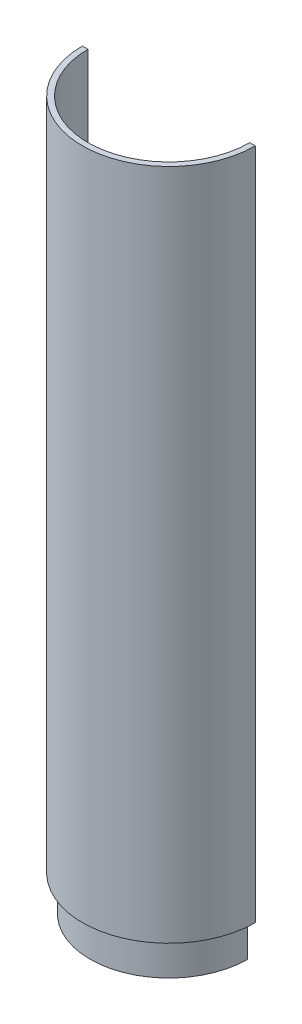
ISO-10303-21;
HEADER;
FILE_DESCRIPTION(('STEP AP214'),'2;1');
FILE_NAME('part.step','',(''),(''),'','','');
FILE_SCHEMA(('AUTOMOTIVE_DESIGN { 1 0 10303 214 1 1 1 1 }'));
ENDSEC;
DATA;
#1=APPLICATION_CONTEXT('core data for automotive mechanical design processes');
#2=APPLICATION_PROTOCOL_DEFINITION('international standard','automotive_design',2000,#1);
#3=PRODUCT_CONTEXT('',#1,'mechanical');
#4=PRODUCT('Part','Part','',(#3));
#5=PRODUCT_RELATED_PRODUCT_CATEGORY('part','',(#4));
#6=PRODUCT_DEFINITION_FORMATION('','',#4);
#7=PRODUCT_DEFINITION_CONTEXT('part definition',#1,'design');
#8=PRODUCT_DEFINITION('design','',#6,#7);
#9=PRODUCT_DEFINITION_SHAPE('','',#8);
#10=(LENGTH_UNIT() NAMED_UNIT(*) SI_UNIT(.MILLI.,.METRE.));
#11=(NAMED_UNIT(*) PLANE_ANGLE_UNIT() SI_UNIT($,.RADIAN.));
#12=(NAMED_UNIT(*) SI_UNIT($,.STERADIAN.) SOLID_ANGLE_UNIT());
#13=UNCERTAINTY_MEASURE_WITH_UNIT(LENGTH_MEASURE(1.E-05),#10,'distance_accuracy_value','');
#14=(GEOMETRIC_REPRESENTATION_CONTEXT(3) GLOBAL_UNCERTAINTY_ASSIGNED_CONTEXT((#13)) GLOBAL_UNIT_ASSIGNED_CONTEXT((#10,
#11,#12)) REPRESENTATION_CONTEXT('',''));
#15=CARTESIAN_POINT('',(0.,0.,0.));
#16=DIRECTION('',(0.,0.,1.));
#17=DIRECTION('',(1.,0.,0.));
#18=AXIS2_PLACEMENT_3D('',#15,#16,#17);
#19=CARTESIAN_POINT('',(0.,-13.97,0.));
#20=DIRECTION('',(0.,1.,0.));
#21=DIRECTION('',(0.,0.,1.));
#22=AXIS2_PLACEMENT_3D('',#19,#20,#21);
#23=CYLINDRICAL_SURFACE('',#22,6.0325);
#24=CARTESIAN_POINT('',(0.,-10.795,0.));
#25=DIRECTION('',(0.,1.,0.));
#26=DIRECTION('',(0.,0.,1.));
#27=AXIS2_PLACEMENT_3D('',#24,#25,#26);
#28=CIRCLE('',#27,6.0325);
#29=CARTESIAN_POINT('',(0.,-10.795,6.0325));
#30=VERTEX_POINT('',#29);
#31=EDGE_CURVE('E175',#30,#30,#28,.T.);
#32=ORIENTED_EDGE('',*,*,#31,.T.);
#33=EDGE_LOOP('',(#32));
#34=FACE_BOUND('',#33,.T.);
#35=CARTESIAN_POINT('',(0.,-15.24,0.));
#36=DIRECTION('',(0.,-1.,0.));
#37=DIRECTION('',(0.,0.,-1.));
#38=AXIS2_PLACEMENT_3D('',#35,#36,#37);
#39=CIRCLE('',#38,6.0325);
#40=CARTESIAN_POINT('',(0.,-15.24,-6.0325));
#41=VERTEX_POINT('',#40);
#42=EDGE_CURVE('E43',#41,#41,#39,.F.);
#43=ORIENTED_EDGE('',*,*,#42,.F.);
#44=EDGE_LOOP('',(#43));
#45=FACE_BOUND('',#44,.T.);
#46=ADVANCED_FACE('F39',(#34,#45),#23,.F.);
#47=CARTESIAN_POINT('',(0.,384.81,0.));
#48=DIRECTION('',(0.,-1.,0.));
#49=DIRECTION('',(0.,0.,-1.));
#50=AXIS2_PLACEMENT_3D('',#47,#48,#49);
#51=CYLINDRICAL_SURFACE('',#50,12.7);
#52=DIRECTION('',(0.,-1.,0.));
#53=VECTOR('',#52,1.);
#54=CARTESIAN_POINT('',(-12.7,384.81,0.));
#55=LINE('',#54,#53);
#56=CARTESIAN_POINT('',(-12.7,-5.71500000000003,0.));
#57=VERTEX_POINT('',#56);
#58=CARTESIAN_POINT('',(-12.7,-20.32,0.));
#59=VERTEX_POINT('',#58);
#60=EDGE_CURVE('E129',#57,#59,#55,.T.);
#61=ORIENTED_EDGE('',*,*,#60,.F.);
#62=CARTESIAN_POINT('',(0.,-5.71500000000003,0.));
#63=DIRECTION('',(0.,1.,0.));
#64=DIRECTION('',(0.,0.,1.));
#65=AXIS2_PLACEMENT_3D('',#62,#63,#64);
#66=CIRCLE('',#65,12.7);
#67=CARTESIAN_POINT('',(12.7,-5.71500000000003,0.));
#68=VERTEX_POINT('',#67);
#69=EDGE_CURVE('E11',#57,#68,#66,.F.);
#70=ORIENTED_EDGE('',*,*,#69,.T.);
#71=DIRECTION('',(0.,-1.,0.));
#72=VECTOR('',#71,1.);
#73=CARTESIAN_POINT('',(12.7,384.81,0.));
#74=LINE('',#73,#72);
#75=CARTESIAN_POINT('',(12.7,-20.32,0.));
#76=VERTEX_POINT('',#75);
#77=EDGE_CURVE('E121',#68,#76,#74,.T.);
#78=ORIENTED_EDGE('',*,*,#77,.T.);
#79=CARTESIAN_POINT('',(0.,-20.32,0.));
#80=DIRECTION('',(0.,-1.,0.));
#81=DIRECTION('',(0.,0.,-1.));
#82=AXIS2_PLACEMENT_3D('',#79,#80,#81);
#83=CIRCLE('',#82,12.7);
#84=EDGE_CURVE('E126',#59,#76,#83,.T.);
#85=ORIENTED_EDGE('',*,*,#84,.F.);
#86=EDGE_LOOP('',(#61,#70,#78,#85));
#87=FACE_BOUND('',#86,.T.);
#88=ADVANCED_FACE('F124',(#87),#51,.T.);
#89=CARTESIAN_POINT('',(0.,-6.35,0.));
#90=DIRECTION('',(0.,1.,0.));
#91=DIRECTION('',(0.,0.,1.));
#92=AXIS2_PLACEMENT_3D('',#89,#90,#91);
#93=CYLINDRICAL_SURFACE('',#92,49.4538);
#94=DIRECTION('',(0.,-1.,0.));
#95=VECTOR('',#94,1.);
#96=CARTESIAN_POINT('',(-49.4538,384.81,0.));
#97=LINE('',#96,#95);
#98=CARTESIAN_POINT('',(-49.4538,384.81,0.));
#99=VERTEX_POINT('',#98);
#100=CARTESIAN_POINT('',(-49.4538,0.,0.));
#101=VERTEX_POINT('',#100);
#102=EDGE_CURVE('E224',#99,#101,#97,.T.);
#103=ORIENTED_EDGE('',*,*,#102,.T.);
#104=CARTESIAN_POINT('',(0.,0.,0.));
#105=DIRECTION('',(0.,-1.,0.));
#106=DIRECTION('',(0.,0.,-1.));
#107=AXIS2_PLACEMENT_3D('',#104,#105,#106);
#108=CIRCLE('',#107,49.4538);
#109=CARTESIAN_POINT('',(49.4538,0.,0.));
#110=VERTEX_POINT('',#109);
#111=EDGE_CURVE('E208',#110,#101,#108,.T.);
#112=ORIENTED_EDGE('',*,*,#111,.F.);
#113=DIRECTION('',(0.,-1.,0.));
#114=VECTOR('',#113,1.);
#115=CARTESIAN_POINT('',(49.4538,384.81,0.));
#116=LINE('',#115,#114);
#117=CARTESIAN_POINT('',(49.4538,384.81,0.));
#118=VERTEX_POINT('',#117);
#119=EDGE_CURVE('E130',#118,#110,#116,.T.);
#120=ORIENTED_EDGE('',*,*,#119,.F.);
#121=CARTESIAN_POINT('',(0.,384.81,0.));
#122=DIRECTION('',(0.,1.,0.));
#123=DIRECTION('',(0.,0.,1.));
#124=AXIS2_PLACEMENT_3D('',#121,#122,#123);
#125=CIRCLE('',#124,49.4538);
#126=EDGE_CURVE('E240',#99,#118,#125,.T.);
#127=ORIENTED_EDGE('',*,*,#126,.F.);
#128=EDGE_LOOP('',(#103,#112,#120,#127));
#129=FACE_BOUND('',#128,.T.);
#130=ADVANCED_FACE('F41',(#129),#93,.T.);
#131=CARTESIAN_POINT('',(-12.7,384.81,0.));
#132=DIRECTION('',(0.,0.,1.));
#133=DIRECTION('',(1.,0.,0.));
#134=AXIS2_PLACEMENT_3D('',#131,#132,#133);
#135=PLANE('',#134);
#136=DIRECTION('',(0.,1.,0.));
#137=VECTOR('',#136,1.);
#138=CARTESIAN_POINT('',(-46.2788,-6.35,0.));
#139=LINE('',#138,#137);
#140=CARTESIAN_POINT('',(-46.2788,5.715,0.));
#141=VERTEX_POINT('',#140);
#142=CARTESIAN_POINT('',(-46.2788,384.81,0.));
#143=VERTEX_POINT('',#142);
#144=EDGE_CURVE('E57',#141,#143,#139,.T.);
#145=ORIENTED_EDGE('',*,*,#144,.F.);
#146=DIRECTION('',(-1.,0.,0.));
#147=VECTOR('',#146,1.);
#148=CARTESIAN_POINT('',(-46.2788,5.715,0.));
#149=LINE('',#148,#147);
#150=CARTESIAN_POINT('',(-35.56,5.715,0.));
#151=VERTEX_POINT('',#150);
#152=EDGE_CURVE('E172',#151,#141,#149,.T.);
#153=ORIENTED_EDGE('',*,*,#152,.F.);
#154=DIRECTION('',(0.,1.,0.));
#155=VECTOR('',#154,1.);
#156=CARTESIAN_POINT('',(-35.56,-5.715,0.));
#157=LINE('',#156,#155);
#158=CARTESIAN_POINT('',(-35.56,-5.715,0.));
#159=VERTEX_POINT('',#158);
#160=EDGE_CURVE('E194',#151,#159,#157,.F.);
#161=ORIENTED_EDGE('',*,*,#160,.T.);
#162=DIRECTION('',(-1.,0.,0.));
#163=VECTOR('',#162,1.);
#164=CARTESIAN_POINT('',(-12.7,-5.71500000000003,0.));
#165=LINE('',#164,#163);
#166=EDGE_CURVE('E201',#57,#159,#165,.T.);
#167=ORIENTED_EDGE('',*,*,#166,.F.);
#168=ORIENTED_EDGE('',*,*,#60,.T.);
#169=DIRECTION('',(1.,0.,0.));
#170=VECTOR('',#169,1.);
#171=CARTESIAN_POINT('',(-45.085,-20.32,0.));
#172=LINE('',#171,#170);
#173=CARTESIAN_POINT('',(-45.085,-20.32,0.));
#174=VERTEX_POINT('',#173);
#175=EDGE_CURVE('E146',#174,#59,#172,.T.);
#176=ORIENTED_EDGE('',*,*,#175,.F.);
#177=DIRECTION('',(0.,-1.,0.));
#178=VECTOR('',#177,1.);
#179=CARTESIAN_POINT('',(-45.085,0.,0.));
#180=LINE('',#179,#178);
#181=CARTESIAN_POINT('',(-45.085,0.,0.));
#182=VERTEX_POINT('',#181);
#183=EDGE_CURVE('E211',#182,#174,#180,.T.);
#184=ORIENTED_EDGE('',*,*,#183,.F.);
#185=DIRECTION('',(1.,0.,0.));
#186=VECTOR('',#185,1.);
#187=CARTESIAN_POINT('',(-12.7,0.,0.));
#188=LINE('',#187,#186);
#189=EDGE_CURVE('E214',#101,#182,#188,.T.);
#190=ORIENTED_EDGE('',*,*,#189,.F.);
#191=ORIENTED_EDGE('',*,*,#102,.F.);
#192=DIRECTION('',(-1.,0.,0.));
#193=VECTOR('',#192,1.);
#194=CARTESIAN_POINT('',(-12.7,384.81,0.));
#195=LINE('',#194,#193);
#196=EDGE_CURVE('E217',#143,#99,#195,.T.);
#197=ORIENTED_EDGE('',*,*,#196,.F.);
#198=EDGE_LOOP('',(#145,#153,#161,#167,#168,#176,#184,#190,#191,#197));
#199=FACE_BOUND('',#198,.T.);
#200=ADVANCED_FACE('F268',(#199),#135,.F.);
#201=CARTESIAN_POINT('',(49.4538,384.81,0.));
#202=DIRECTION('',(0.,0.,1.));
#203=DIRECTION('',(1.,0.,0.));
#204=AXIS2_PLACEMENT_3D('',#201,#202,#203);
#205=PLANE('',#204);
#206=DIRECTION('',(-1.,0.,0.));
#207=VECTOR('',#206,1.);
#208=CARTESIAN_POINT('',(49.4538,-5.71500000000003,0.));
#209=LINE('',#208,#207);
#210=CARTESIAN_POINT('',(35.56,-5.715,0.));
#211=VERTEX_POINT('',#210);
#212=EDGE_CURVE('E198',#211,#68,#209,.T.);
#213=ORIENTED_EDGE('',*,*,#212,.F.);
#214=DIRECTION('',(0.,1.,0.));
#215=VECTOR('',#214,1.);
#216=CARTESIAN_POINT('',(35.56,-5.715,0.));
#217=LINE('',#216,#215);
#218=CARTESIAN_POINT('',(35.56,5.715,0.));
#219=VERTEX_POINT('',#218);
#220=EDGE_CURVE('E191',#211,#219,#217,.T.);
#221=ORIENTED_EDGE('',*,*,#220,.T.);
#222=DIRECTION('',(-1.,0.,0.));
#223=VECTOR('',#222,1.);
#224=CARTESIAN_POINT('',(35.56,5.715,0.));
#225=LINE('',#224,#223);
#226=CARTESIAN_POINT('',(46.2788,5.715,0.));
#227=VERTEX_POINT('',#226);
#228=EDGE_CURVE('E164',#227,#219,#225,.T.);
#229=ORIENTED_EDGE('',*,*,#228,.F.);
#230=DIRECTION('',(0.,1.,0.));
#231=VECTOR('',#230,1.);
#232=CARTESIAN_POINT('',(46.2788,-6.35,0.));
#233=LINE('',#232,#231);
#234=CARTESIAN_POINT('',(46.2788,384.81,0.));
#235=VERTEX_POINT('',#234);
#236=EDGE_CURVE('E65',#235,#227,#233,.F.);
#237=ORIENTED_EDGE('',*,*,#236,.F.);
#238=DIRECTION('',(-1.,0.,0.));
#239=VECTOR('',#238,1.);
#240=CARTESIAN_POINT('',(49.4538,384.81,0.));
#241=LINE('',#240,#239);
#242=EDGE_CURVE('E221',#118,#235,#241,.T.);
#243=ORIENTED_EDGE('',*,*,#242,.F.);
#244=ORIENTED_EDGE('',*,*,#119,.T.);
#245=DIRECTION('',(1.,0.,0.));
#246=VECTOR('',#245,1.);
#247=CARTESIAN_POINT('',(49.4538,0.,0.));
#248=LINE('',#247,#246);
#249=CARTESIAN_POINT('',(45.085,0.,0.));
#250=VERTEX_POINT('',#249);
#251=EDGE_CURVE('E49',#250,#110,#248,.T.);
#252=ORIENTED_EDGE('',*,*,#251,.F.);
#253=DIRECTION('',(0.,-1.,0.));
#254=VECTOR('',#253,1.);
#255=CARTESIAN_POINT('',(45.085,0.,0.));
#256=LINE('',#255,#254);
#257=CARTESIAN_POINT('',(45.085,-20.32,0.));
#258=VERTEX_POINT('',#257);
#259=EDGE_CURVE('E136',#258,#250,#256,.F.);
#260=ORIENTED_EDGE('',*,*,#259,.F.);
#261=DIRECTION('',(1.,0.,0.));
#262=VECTOR('',#261,1.);
#263=CARTESIAN_POINT('',(12.7,-20.32,0.));
#264=LINE('',#263,#262);
#265=EDGE_CURVE('E133',#76,#258,#264,.T.);
#266=ORIENTED_EDGE('',*,*,#265,.F.);
#267=ORIENTED_EDGE('',*,*,#77,.F.);
#268=EDGE_LOOP('',(#213,#221,#229,#237,#243,#244,#252,#260,#266,#267));
#269=FACE_BOUND('',#268,.T.);
#270=ADVANCED_FACE('F134',(#269),#205,.F.);
#271=CARTESIAN_POINT('',(0.,384.81,0.));
#272=DIRECTION('',(0.,1.,0.));
#273=DIRECTION('',(0.,0.,1.));
#274=AXIS2_PLACEMENT_3D('',#271,#272,#273);
#275=PLANE('',#274);
#276=ORIENTED_EDGE('',*,*,#196,.T.);
#277=ORIENTED_EDGE('',*,*,#126,.T.);
#278=ORIENTED_EDGE('',*,*,#242,.T.);
#279=CARTESIAN_POINT('',(0.,384.81,0.));
#280=DIRECTION('',(0.,1.,0.));
#281=DIRECTION('',(0.,0.,1.));
#282=AXIS2_PLACEMENT_3D('',#279,#280,#281);
#283=CIRCLE('',#282,46.2788);
#284=EDGE_CURVE('E237',#143,#235,#283,.T.);
#285=ORIENTED_EDGE('',*,*,#284,.F.);
#286=EDGE_LOOP('',(#276,#277,#278,#285));
#287=FACE_BOUND('',#286,.T.);
#288=ADVANCED_FACE('F274',(#287),#275,.T.);
#289=CARTESIAN_POINT('',(0.,-6.35,0.));
#290=DIRECTION('',(0.,1.,0.));
#291=DIRECTION('',(0.,0.,1.));
#292=AXIS2_PLACEMENT_3D('',#289,#290,#291);
#293=CYLINDRICAL_SURFACE('',#292,46.2788);
#294=ORIENTED_EDGE('',*,*,#236,.T.);
#295=CARTESIAN_POINT('',(0.,5.715,0.));
#296=DIRECTION('',(0.,1.,0.));
#297=DIRECTION('',(0.,0.,1.));
#298=AXIS2_PLACEMENT_3D('',#295,#296,#297);
#299=CIRCLE('',#298,46.2788);
#300=EDGE_CURVE('E160',#141,#227,#299,.T.);
#301=ORIENTED_EDGE('',*,*,#300,.F.);
#302=ORIENTED_EDGE('',*,*,#144,.T.);
#303=ORIENTED_EDGE('',*,*,#284,.T.);
#304=EDGE_LOOP('',(#294,#301,#302,#303));
#305=FACE_BOUND('',#304,.T.);
#306=ADVANCED_FACE('F271',(#305),#293,.F.);
#307=CARTESIAN_POINT('',(0.,0.,0.));
#308=DIRECTION('',(0.,-1.,0.));
#309=DIRECTION('',(0.,0.,-1.));
#310=AXIS2_PLACEMENT_3D('',#307,#308,#309);
#311=PLANE('',#310);
#312=ORIENTED_EDGE('',*,*,#189,.T.);
#313=CARTESIAN_POINT('',(0.,0.,0.));
#314=DIRECTION('',(0.,-1.,0.));
#315=DIRECTION('',(0.,0.,-1.));
#316=AXIS2_PLACEMENT_3D('',#313,#314,#315);
#317=CIRCLE('',#316,45.085);
#318=EDGE_CURVE('E204',#250,#182,#317,.T.);
#319=ORIENTED_EDGE('',*,*,#318,.F.);
#320=ORIENTED_EDGE('',*,*,#251,.T.);
#321=ORIENTED_EDGE('',*,*,#111,.T.);
#322=EDGE_LOOP('',(#312,#319,#320,#321));
#323=FACE_BOUND('',#322,.T.);
#324=ADVANCED_FACE('F281',(#323),#311,.T.);
#325=CARTESIAN_POINT('',(0.,0.,0.));
#326=DIRECTION('',(0.,-1.,0.));
#327=DIRECTION('',(0.,0.,-1.));
#328=AXIS2_PLACEMENT_3D('',#325,#326,#327);
#329=CYLINDRICAL_SURFACE('',#328,45.085);
#330=ORIENTED_EDGE('',*,*,#183,.T.);
#331=CARTESIAN_POINT('',(0.,-20.32,0.));
#332=DIRECTION('',(0.,-1.,0.));
#333=DIRECTION('',(0.,0.,-1.));
#334=AXIS2_PLACEMENT_3D('',#331,#332,#333);
#335=CIRCLE('',#334,45.085);
#336=EDGE_CURVE('E141',#258,#174,#335,.T.);
#337=ORIENTED_EDGE('',*,*,#336,.F.);
#338=ORIENTED_EDGE('',*,*,#259,.T.);
#339=ORIENTED_EDGE('',*,*,#318,.T.);
#340=EDGE_LOOP('',(#330,#337,#338,#339));
#341=FACE_BOUND('',#340,.T.);
#342=ADVANCED_FACE('F258',(#341),#329,.T.);
#343=CARTESIAN_POINT('',(0.,-5.715,0.));
#344=DIRECTION('',(0.,1.,0.));
#345=DIRECTION('',(0.,0.,1.));
#346=AXIS2_PLACEMENT_3D('',#343,#344,#345);
#347=PLANE('',#346);
#348=CARTESIAN_POINT('',(0.,-5.71500000000003,15.24));
#349=DIRECTION('',(0.,1.,0.));
#350=DIRECTION('',(0.,0.,1.));
#351=AXIS2_PLACEMENT_3D('',#348,#349,#350);
#352=CIRCLE('',#351,4.191);
#353=CARTESIAN_POINT('',(0.,-5.71500000000003,19.431));
#354=VERTEX_POINT('',#353);
#355=EDGE_CURVE('E159',#354,#354,#352,.T.);
#356=ORIENTED_EDGE('',*,*,#355,.F.);
#357=EDGE_LOOP('',(#356));
#358=FACE_BOUND('',#357,.T.);
#359=CARTESIAN_POINT('',(0.,-5.715,0.));
#360=DIRECTION('',(0.,1.,0.));
#361=DIRECTION('',(0.,0.,1.));
#362=AXIS2_PLACEMENT_3D('',#359,#360,#361);
#363=CIRCLE('',#362,8.382);
#364=CARTESIAN_POINT('',(0.,-5.715,8.382));
#365=VERTEX_POINT('',#364);
#366=EDGE_CURVE('E179',#365,#365,#363,.T.);
#367=ORIENTED_EDGE('',*,*,#366,.F.);
#368=EDGE_LOOP('',(#367));
#369=FACE_BOUND('',#368,.T.);
#370=ORIENTED_EDGE('',*,*,#166,.T.);
#371=CARTESIAN_POINT('',(0.,-5.715,0.));
#372=DIRECTION('',(0.,1.,0.));
#373=DIRECTION('',(0.,0.,1.));
#374=AXIS2_PLACEMENT_3D('',#371,#372,#373);
#375=CIRCLE('',#374,35.56);
#376=EDGE_CURVE('E184',#159,#211,#375,.T.);
#377=ORIENTED_EDGE('',*,*,#376,.T.);
#378=ORIENTED_EDGE('',*,*,#212,.T.);
#379=ORIENTED_EDGE('',*,*,#69,.F.);
#380=EDGE_LOOP('',(#370,#377,#378,#379));
#381=FACE_BOUND('',#380,.T.);
#382=ADVANCED_FACE('F254',(#358,#369,#381),#347,.T.);
#383=CARTESIAN_POINT('',(0.,-5.715,0.));
#384=DIRECTION('',(0.,1.,0.));
#385=DIRECTION('',(0.,0.,1.));
#386=AXIS2_PLACEMENT_3D('',#383,#384,#385);
#387=CYLINDRICAL_SURFACE('',#386,35.56);
#388=ORIENTED_EDGE('',*,*,#160,.F.);
#389=CARTESIAN_POINT('',(0.,5.715,0.));
#390=DIRECTION('',(0.,-1.,0.));
#391=DIRECTION('',(0.,0.,1.));
#392=AXIS2_PLACEMENT_3D('',#389,#390,#391);
#393=CIRCLE('',#392,35.56);
#394=EDGE_CURVE('E168',#219,#151,#393,.T.);
#395=ORIENTED_EDGE('',*,*,#394,.F.);
#396=ORIENTED_EDGE('',*,*,#220,.F.);
#397=ORIENTED_EDGE('',*,*,#376,.F.);
#398=EDGE_LOOP('',(#388,#395,#396,#397));
#399=FACE_BOUND('',#398,.T.);
#400=ADVANCED_FACE('F257',(#399),#387,.F.);
#401=CARTESIAN_POINT('',(0.,-10.795,0.));
#402=DIRECTION('',(0.,1.,0.));
#403=DIRECTION('',(0.,0.,1.));
#404=AXIS2_PLACEMENT_3D('',#401,#402,#403);
#405=CYLINDRICAL_SURFACE('',#404,8.382);
#406=CARTESIAN_POINT('',(0.,-10.795,0.));
#407=DIRECTION('',(0.,1.,0.));
#408=DIRECTION('',(0.,0.,1.));
#409=AXIS2_PLACEMENT_3D('',#406,#407,#408);
#410=CIRCLE('',#409,8.382);
#411=CARTESIAN_POINT('',(0.,-10.795,8.382));
#412=VERTEX_POINT('',#411);
#413=EDGE_CURVE('E180',#412,#412,#410,.T.);
#414=ORIENTED_EDGE('',*,*,#413,.F.);
#415=EDGE_LOOP('',(#414));
#416=FACE_BOUND('',#415,.T.);
#417=ORIENTED_EDGE('',*,*,#366,.T.);
#418=EDGE_LOOP('',(#417));
#419=FACE_BOUND('',#418,.T.);
#420=ADVANCED_FACE('F306',(#416,#419),#405,.F.);
#421=CARTESIAN_POINT('',(0.,-10.795,0.));
#422=DIRECTION('',(0.,1.,0.));
#423=DIRECTION('',(0.,0.,1.));
#424=AXIS2_PLACEMENT_3D('',#421,#422,#423);
#425=PLANE('',#424);
#426=ORIENTED_EDGE('',*,*,#31,.F.);
#427=EDGE_LOOP('',(#426));
#428=FACE_BOUND('',#427,.T.);
#429=ORIENTED_EDGE('',*,*,#413,.T.);
#430=EDGE_LOOP('',(#429));
#431=FACE_BOUND('',#430,.T.);
#432=ADVANCED_FACE('F303',(#428,#431),#425,.T.);
#433=CARTESIAN_POINT('',(0.,5.715,0.));
#434=DIRECTION('',(0.,1.,0.));
#435=DIRECTION('',(0.,0.,1.));
#436=AXIS2_PLACEMENT_3D('',#433,#434,#435);
#437=PLANE('',#436);
#438=ORIENTED_EDGE('',*,*,#300,.T.);
#439=ORIENTED_EDGE('',*,*,#228,.T.);
#440=ORIENTED_EDGE('',*,*,#394,.T.);
#441=ORIENTED_EDGE('',*,*,#152,.T.);
#442=EDGE_LOOP('',(#438,#439,#440,#441));
#443=FACE_BOUND('',#442,.T.);
#444=ADVANCED_FACE('F270',(#443),#437,.T.);
#445=CARTESIAN_POINT('',(0.,384.81,15.24));
#446=DIRECTION('',(0.,-1.,0.));
#447=DIRECTION('',(0.,0.,-1.));
#448=AXIS2_PLACEMENT_3D('',#445,#446,#447);
#449=CYLINDRICAL_SURFACE('',#448,4.191);
#450=ORIENTED_EDGE('',*,*,#355,.T.);
#451=EDGE_LOOP('',(#450));
#452=FACE_BOUND('',#451,.T.);
#453=CARTESIAN_POINT('',(0.,-20.32,15.24));
#454=DIRECTION('',(0.,-1.,0.));
#455=DIRECTION('',(0.,0.,-1.));
#456=AXIS2_PLACEMENT_3D('',#453,#454,#455);
#457=CIRCLE('',#456,4.191);
#458=CARTESIAN_POINT('',(0.,-20.32,11.049));
#459=VERTEX_POINT('',#458);
#460=EDGE_CURVE('E148',#459,#459,#457,.T.);
#461=ORIENTED_EDGE('',*,*,#460,.T.);
#462=EDGE_LOOP('',(#461));
#463=FACE_BOUND('',#462,.T.);
#464=ADVANCED_FACE('F251',(#452,#463),#449,.F.);
#465=CARTESIAN_POINT('',(0.,-20.32,0.));
#466=DIRECTION('',(0.,-1.,0.));
#467=DIRECTION('',(0.,0.,-1.));
#468=AXIS2_PLACEMENT_3D('',#465,#466,#467);
#469=PLANE('',#468);
#470=CARTESIAN_POINT('',(0.,-20.32,0.));
#471=DIRECTION('',(0.,1.,0.));
#472=DIRECTION('',(0.,0.,1.));
#473=AXIS2_PLACEMENT_3D('',#470,#471,#472);
#474=CIRCLE('',#473,8.382);
#475=CARTESIAN_POINT('',(0.,-20.32,8.382));
#476=VERTEX_POINT('',#475);
#477=EDGE_CURVE('E496',#476,#476,#474,.T.);
#478=ORIENTED_EDGE('',*,*,#477,.T.);
#479=EDGE_LOOP('',(#478));
#480=FACE_BOUND('',#479,.T.);
#481=ORIENTED_EDGE('',*,*,#460,.F.);
#482=EDGE_LOOP('',(#481));
#483=FACE_BOUND('',#482,.T.);
#484=ORIENTED_EDGE('',*,*,#84,.T.);
#485=ORIENTED_EDGE('',*,*,#265,.T.);
#486=ORIENTED_EDGE('',*,*,#336,.T.);
#487=ORIENTED_EDGE('',*,*,#175,.T.);
#488=EDGE_LOOP('',(#484,#485,#486,#487));
#489=FACE_BOUND('',#488,.T.);
#490=ADVANCED_FACE('F144',(#480,#483,#489),#469,.T.);
#491=CARTESIAN_POINT('',(0.,-15.24,0.));
#492=DIRECTION('',(0.,-1.,0.));
#493=DIRECTION('',(0.,0.,1.));
#494=AXIS2_PLACEMENT_3D('',#491,#492,#493);
#495=PLANE('',#494);
#496=CARTESIAN_POINT('',(0.,-15.24,0.));
#497=DIRECTION('',(0.,1.,0.));
#498=DIRECTION('',(0.,0.,1.));
#499=AXIS2_PLACEMENT_3D('',#496,#497,#498);
#500=CIRCLE('',#499,8.382);
#501=CARTESIAN_POINT('',(0.,-15.24,8.382));
#502=VERTEX_POINT('',#501);
#503=EDGE_CURVE('E493',#502,#502,#500,.T.);
#504=ORIENTED_EDGE('',*,*,#503,.F.);
#505=EDGE_LOOP('',(#504));
#506=FACE_BOUND('',#505,.T.);
#507=ORIENTED_EDGE('',*,*,#42,.T.);
#508=EDGE_LOOP('',(#507));
#509=FACE_BOUND('',#508,.T.);
#510=ADVANCED_FACE('F341',(#506,#509),#495,.T.);
#511=CARTESIAN_POINT('',(0.,-15.24,0.));
#512=DIRECTION('',(0.,-1.,0.));
#513=DIRECTION('',(0.,0.,-1.));
#514=AXIS2_PLACEMENT_3D('',#511,#512,#513);
#515=CYLINDRICAL_SURFACE('',#514,8.382);
#516=ORIENTED_EDGE('',*,*,#503,.T.);
#517=EDGE_LOOP('',(#516));
#518=FACE_BOUND('',#517,.T.);
#519=ORIENTED_EDGE('',*,*,#477,.F.);
#520=EDGE_LOOP('',(#519));
#521=FACE_BOUND('',#520,.T.);
#522=ADVANCED_FACE('F349',(#518,#521),#515,.F.);
#523=CLOSED_SHELL('',(#46,#88,#130,#200,#270,#288,#306,#324,#342,#382,#400,#420,#432,#444,#464,
#490,#510,#522));
#524=MANIFOLD_SOLID_BREP('B2',#523);
#525=ADVANCED_BREP_SHAPE_REPRESENTATION('',(#18,#524),#14);
#526=SHAPE_DEFINITION_REPRESENTATION(#9,#525);
ENDSEC;
END-ISO-10303-21;
